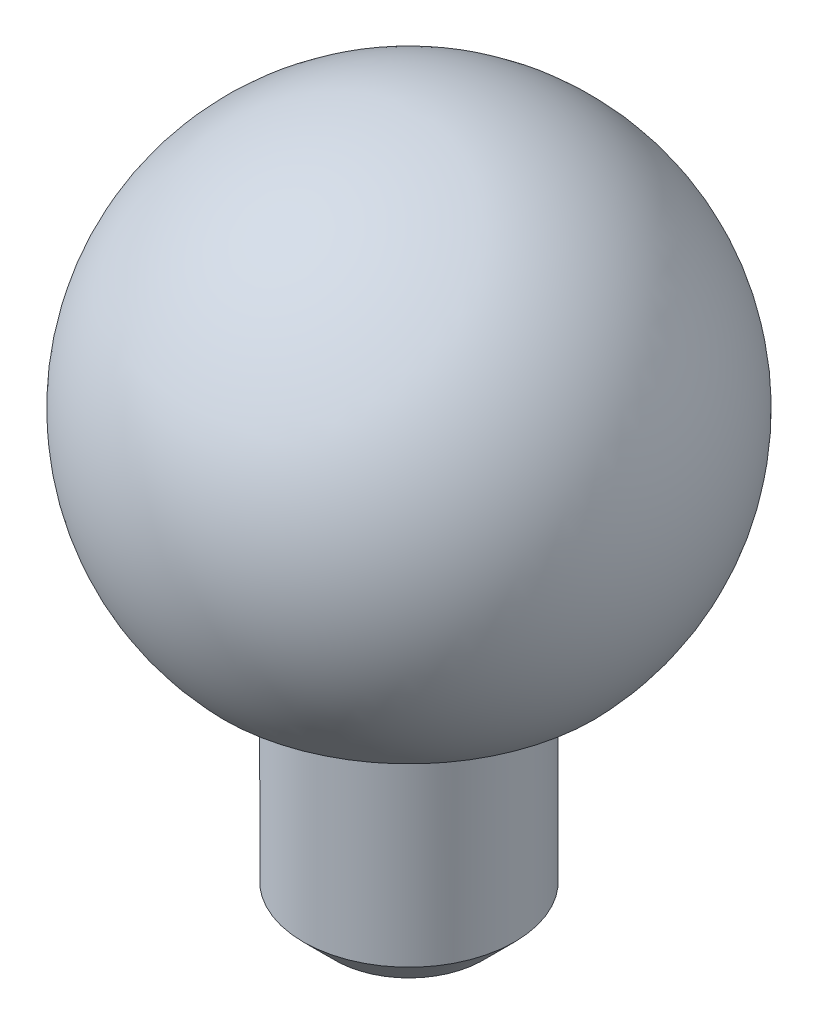
ISO-10303-21;
HEADER;
FILE_DESCRIPTION(('STEP AP214'),'2;1');
FILE_NAME('part.step','',(''),(''),'','','');
FILE_SCHEMA(('AUTOMOTIVE_DESIGN { 1 0 10303 214 1 1 1 1 }'));
ENDSEC;
DATA;
#1=APPLICATION_CONTEXT('core data for automotive mechanical design processes');
#2=APPLICATION_PROTOCOL_DEFINITION('international standard','automotive_design',2000,#1);
#3=PRODUCT_CONTEXT('',#1,'mechanical');
#4=PRODUCT('Part','Part','',(#3));
#5=PRODUCT_RELATED_PRODUCT_CATEGORY('part','',(#4));
#6=PRODUCT_DEFINITION_FORMATION('','',#4);
#7=PRODUCT_DEFINITION_CONTEXT('part definition',#1,'design');
#8=PRODUCT_DEFINITION('design','',#6,#7);
#9=PRODUCT_DEFINITION_SHAPE('','',#8);
#10=(LENGTH_UNIT() NAMED_UNIT(*) SI_UNIT(.MILLI.,.METRE.));
#11=(NAMED_UNIT(*) PLANE_ANGLE_UNIT() SI_UNIT($,.RADIAN.));
#12=(NAMED_UNIT(*) SI_UNIT($,.STERADIAN.) SOLID_ANGLE_UNIT());
#13=UNCERTAINTY_MEASURE_WITH_UNIT(LENGTH_MEASURE(1.E-05),#10,'distance_accuracy_value','');
#14=(GEOMETRIC_REPRESENTATION_CONTEXT(3) GLOBAL_UNCERTAINTY_ASSIGNED_CONTEXT((#13)) GLOBAL_UNIT_ASSIGNED_CONTEXT((#10,
#11,#12)) REPRESENTATION_CONTEXT('',''));
#15=CARTESIAN_POINT('',(0.,0.,0.));
#16=DIRECTION('',(0.,0.,1.));
#17=DIRECTION('',(1.,0.,0.));
#18=AXIS2_PLACEMENT_3D('',#15,#16,#17);
#19=CARTESIAN_POINT('',(0.,-3.35,0.));
#20=DIRECTION('',(0.,1.,0.));
#21=DIRECTION('',(0.,0.,1.));
#22=AXIS2_PLACEMENT_3D('',#19,#20,#21);
#23=PLANE('',#22);
#24=CARTESIAN_POINT('',(0.,-3.35,0.));
#25=DIRECTION('',(0.,1.,0.));
#26=DIRECTION('',(0.,0.,1.));
#27=AXIS2_PLACEMENT_3D('',#24,#25,#26);
#28=CIRCLE('',#27,3.50713558335004);
#29=CARTESIAN_POINT('',(0.,-3.35,3.50713558335004));
#30=VERTEX_POINT('',#29);
#31=EDGE_CURVE('E51',#30,#30,#28,.T.);
#32=ORIENTED_EDGE('',*,*,#31,.F.);
#33=EDGE_LOOP('',(#32));
#34=FACE_BOUND('',#33,.T.);
#35=CARTESIAN_POINT('',(0.,-3.35,0.));
#36=DIRECTION('',(0.,1.,0.));
#37=DIRECTION('',(0.,0.,1.));
#38=AXIS2_PLACEMENT_3D('',#35,#36,#37);
#39=CIRCLE('',#38,2.);
#40=CARTESIAN_POINT('',(0.,-3.35,2.));
#41=VERTEX_POINT('',#40);
#42=EDGE_CURVE('E47',#41,#41,#39,.F.);
#43=ORIENTED_EDGE('',*,*,#42,.F.);
#44=EDGE_LOOP('',(#43));
#45=FACE_BOUND('',#44,.T.);
#46=ADVANCED_FACE('F36',(#34,#45),#23,.F.);
#47=CARTESIAN_POINT('',(0.,0.,0.));
#48=DIRECTION('',(0.,1.,0.));
#49=DIRECTION('',(0.,0.,-1.));
#50=AXIS2_PLACEMENT_3D('',#47,#48,#49);
#51=SPHERICAL_SURFACE('',#50,4.85);
#52=ORIENTED_EDGE('',*,*,#31,.T.);
#53=EDGE_LOOP('',(#52));
#54=FACE_BOUND('',#53,.T.);
#55=ADVANCED_FACE('F57',(#54),#51,.T.);
#56=CARTESIAN_POINT('',(0.,-8.35,0.));
#57=DIRECTION('',(0.,1.,0.));
#58=DIRECTION('',(0.,0.,1.));
#59=AXIS2_PLACEMENT_3D('',#56,#57,#58);
#60=CYLINDRICAL_SURFACE('',#59,2.);
#61=CARTESIAN_POINT('',(0.,-7.75,0.));
#62=DIRECTION('',(0.,-1.,0.));
#63=DIRECTION('',(0.,0.,-1.));
#64=AXIS2_PLACEMENT_3D('',#61,#62,#63);
#65=CIRCLE('',#64,2.);
#66=CARTESIAN_POINT('',(0.,-7.75,-2.));
#67=VERTEX_POINT('',#66);
#68=EDGE_CURVE('E10',#67,#67,#65,.F.);
#69=ORIENTED_EDGE('',*,*,#68,.T.);
#70=EDGE_LOOP('',(#69));
#71=FACE_BOUND('',#70,.T.);
#72=ORIENTED_EDGE('',*,*,#42,.T.);
#73=EDGE_LOOP('',(#72));
#74=FACE_BOUND('',#73,.T.);
#75=ADVANCED_FACE('F64',(#71,#74),#60,.T.);
#76=CARTESIAN_POINT('',(0.,-8.35,0.));
#77=DIRECTION('',(0.,-1.,0.));
#78=DIRECTION('',(0.,0.,-1.));
#79=AXIS2_PLACEMENT_3D('',#76,#77,#78);
#80=PLANE('',#79);
#81=CARTESIAN_POINT('',(0.,-8.35,0.));
#82=DIRECTION('',(0.,-1.,0.));
#83=DIRECTION('',(0.,0.,-1.));
#84=AXIS2_PLACEMENT_3D('',#81,#82,#83);
#85=CIRCLE('',#84,1.4);
#86=CARTESIAN_POINT('',(0.,-8.35,-1.4));
#87=VERTEX_POINT('',#86);
#88=EDGE_CURVE('E43',#87,#87,#85,.T.);
#89=ORIENTED_EDGE('',*,*,#88,.T.);
#90=EDGE_LOOP('',(#89));
#91=FACE_BOUND('',#90,.T.);
#92=ADVANCED_FACE('F66',(#91),#80,.T.);
#93=CARTESIAN_POINT('',(0.,-8.35,0.));
#94=DIRECTION('',(0.,1.,0.));
#95=DIRECTION('',(0.,0.,1.));
#96=AXIS2_PLACEMENT_3D('',#93,#94,#95);
#97=CONICAL_SURFACE('',#96,1.4,0.785398163397445);
#98=ORIENTED_EDGE('',*,*,#68,.F.);
#99=EDGE_LOOP('',(#98));
#100=FACE_BOUND('',#99,.T.);
#101=ORIENTED_EDGE('',*,*,#88,.F.);
#102=EDGE_LOOP('',(#101));
#103=FACE_BOUND('',#102,.T.);
#104=ADVANCED_FACE('F38',(#100,#103),#97,.T.);
#105=CLOSED_SHELL('',(#46,#55,#75,#92,#104));
#106=MANIFOLD_SOLID_BREP('B2',#105);
#107=ADVANCED_BREP_SHAPE_REPRESENTATION('',(#18,#106),#14);
#108=SHAPE_DEFINITION_REPRESENTATION(#9,#107);
ENDSEC;
END-ISO-10303-21;
